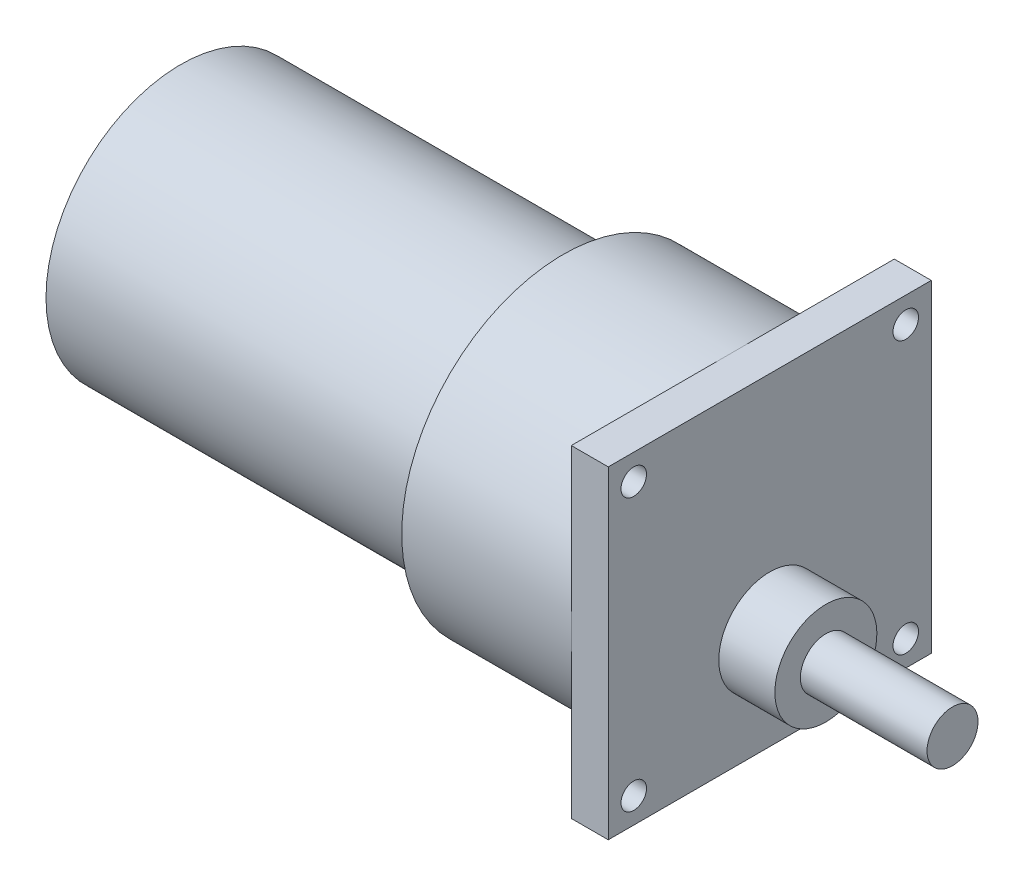
ISO-10303-21;
HEADER;
FILE_DESCRIPTION(('STEP AP214'),'2;1');
FILE_NAME('part.step','',(''),(''),'','','');
FILE_SCHEMA(('AUTOMOTIVE_DESIGN { 1 0 10303 214 1 1 1 1 }'));
ENDSEC;
DATA;
#1=APPLICATION_CONTEXT('core data for automotive mechanical design processes');
#2=APPLICATION_PROTOCOL_DEFINITION('international standard','automotive_design',2000,#1);
#3=PRODUCT_CONTEXT('',#1,'mechanical');
#4=PRODUCT('Part','Part','',(#3));
#5=PRODUCT_RELATED_PRODUCT_CATEGORY('part','',(#4));
#6=PRODUCT_DEFINITION_FORMATION('','',#4);
#7=PRODUCT_DEFINITION_CONTEXT('part definition',#1,'design');
#8=PRODUCT_DEFINITION('design','',#6,#7);
#9=PRODUCT_DEFINITION_SHAPE('','',#8);
#10=(LENGTH_UNIT() NAMED_UNIT(*) SI_UNIT(.MILLI.,.METRE.));
#11=(NAMED_UNIT(*) PLANE_ANGLE_UNIT() SI_UNIT($,.RADIAN.));
#12=(NAMED_UNIT(*) SI_UNIT($,.STERADIAN.) SOLID_ANGLE_UNIT());
#13=UNCERTAINTY_MEASURE_WITH_UNIT(LENGTH_MEASURE(1.E-05),#10,'distance_accuracy_value','');
#14=(GEOMETRIC_REPRESENTATION_CONTEXT(3) GLOBAL_UNCERTAINTY_ASSIGNED_CONTEXT((#13)) GLOBAL_UNIT_ASSIGNED_CONTEXT((#10,
#11,#12)) REPRESENTATION_CONTEXT('',''));
#15=CARTESIAN_POINT('',(0.,0.,0.));
#16=DIRECTION('',(0.,0.,1.));
#17=DIRECTION('',(1.,0.,0.));
#18=AXIS2_PLACEMENT_3D('',#15,#16,#17);
#19=CARTESIAN_POINT('',(0.,0.,0.));
#20=DIRECTION('',(1.,0.,0.));
#21=DIRECTION('',(0.,0.,-1.));
#22=AXIS2_PLACEMENT_3D('',#19,#20,#21);
#23=PLANE('',#22);
#24=CARTESIAN_POINT('',(0.,-16.0000000000001,16.));
#25=DIRECTION('',(1.,0.,0.));
#26=DIRECTION('',(0.,0.,-1.));
#27=AXIS2_PLACEMENT_3D('',#24,#25,#26);
#28=CIRCLE('',#27,1.5);
#29=CARTESIAN_POINT('',(0.,-16.0000000000001,14.5));
#30=VERTEX_POINT('',#29);
#31=EDGE_CURVE('E212',#30,#30,#28,.F.);
#32=ORIENTED_EDGE('',*,*,#31,.T.);
#33=EDGE_LOOP('',(#32));
#34=FACE_BOUND('',#33,.T.);
#35=CARTESIAN_POINT('',(0.,-16.0000000000001,-16.));
#36=DIRECTION('',(1.,0.,0.));
#37=DIRECTION('',(0.,0.,-1.));
#38=AXIS2_PLACEMENT_3D('',#35,#36,#37);
#39=CIRCLE('',#38,1.5);
#40=CARTESIAN_POINT('',(0.,-16.0000000000001,-17.5));
#41=VERTEX_POINT('',#40);
#42=EDGE_CURVE('E216',#41,#41,#39,.T.);
#43=ORIENTED_EDGE('',*,*,#42,.F.);
#44=EDGE_LOOP('',(#43));
#45=FACE_BOUND('',#44,.T.);
#46=CARTESIAN_POINT('',(0.,16.0000000000001,16.));
#47=DIRECTION('',(1.,0.,0.));
#48=DIRECTION('',(0.,0.,-1.));
#49=AXIS2_PLACEMENT_3D('',#46,#47,#48);
#50=CIRCLE('',#49,1.5);
#51=CARTESIAN_POINT('',(0.,16.0000000000001,14.5));
#52=VERTEX_POINT('',#51);
#53=EDGE_CURVE('E220',#52,#52,#50,.T.);
#54=ORIENTED_EDGE('',*,*,#53,.F.);
#55=EDGE_LOOP('',(#54));
#56=FACE_BOUND('',#55,.T.);
#57=CARTESIAN_POINT('',(0.,-7.2,0.));
#58=DIRECTION('',(-1.,0.,0.));
#59=DIRECTION('',(0.,-1.,0.));
#60=AXIS2_PLACEMENT_3D('',#57,#58,#59);
#61=CIRCLE('',#60,6.);
#62=CARTESIAN_POINT('',(0.,-13.2,0.));
#63=VERTEX_POINT('',#62);
#64=EDGE_CURVE('E152',#63,#63,#61,.T.);
#65=ORIENTED_EDGE('',*,*,#64,.T.);
#66=EDGE_LOOP('',(#65));
#67=FACE_BOUND('',#66,.T.);
#68=DIRECTION('',(0.,-1.,0.));
#69=VECTOR('',#68,1.);
#70=CARTESIAN_POINT('',(0.,0.,19.));
#71=LINE('',#70,#69);
#72=CARTESIAN_POINT('',(0.,19.,19.));
#73=VERTEX_POINT('',#72);
#74=CARTESIAN_POINT('',(0.,-19.,19.));
#75=VERTEX_POINT('',#74);
#76=EDGE_CURVE('E179',#73,#75,#71,.T.);
#77=ORIENTED_EDGE('',*,*,#76,.T.);
#78=DIRECTION('',(0.,0.,-1.));
#79=VECTOR('',#78,1.);
#80=CARTESIAN_POINT('',(0.,-19.,0.));
#81=LINE('',#80,#79);
#82=CARTESIAN_POINT('',(0.,-19.,-19.));
#83=VERTEX_POINT('',#82);
#84=EDGE_CURVE('E134',#75,#83,#81,.T.);
#85=ORIENTED_EDGE('',*,*,#84,.T.);
#86=DIRECTION('',(0.,-1.,0.));
#87=VECTOR('',#86,1.);
#88=CARTESIAN_POINT('',(0.,0.,-19.));
#89=LINE('',#88,#87);
#90=CARTESIAN_POINT('',(0.,19.,-19.));
#91=VERTEX_POINT('',#90);
#92=EDGE_CURVE('E160',#91,#83,#89,.T.);
#93=ORIENTED_EDGE('',*,*,#92,.F.);
#94=DIRECTION('',(0.,0.,-1.));
#95=VECTOR('',#94,1.);
#96=CARTESIAN_POINT('',(0.,19.,0.));
#97=LINE('',#96,#95);
#98=EDGE_CURVE('E173',#73,#91,#97,.T.);
#99=ORIENTED_EDGE('',*,*,#98,.F.);
#100=EDGE_LOOP('',(#77,#85,#93,#99));
#101=FACE_BOUND('',#100,.T.);
#102=CARTESIAN_POINT('',(0.,16.0000000000001,-16.));
#103=DIRECTION('',(1.,0.,0.));
#104=DIRECTION('',(0.,0.,-1.));
#105=AXIS2_PLACEMENT_3D('',#102,#103,#104);
#106=CIRCLE('',#105,1.5);
#107=CARTESIAN_POINT('',(0.,16.0000000000001,-17.5));
#108=VERTEX_POINT('',#107);
#109=EDGE_CURVE('E227',#108,#108,#106,.F.);
#110=ORIENTED_EDGE('',*,*,#109,.T.);
#111=EDGE_LOOP('',(#110));
#112=FACE_BOUND('',#111,.T.);
#113=ADVANCED_FACE('F71',(#34,#45,#56,#67,#101,#112),#23,.T.);
#114=CARTESIAN_POINT('',(-24.3,0.,0.));
#115=DIRECTION('',(1.,0.,0.));
#116=DIRECTION('',(0.,0.,-1.));
#117=AXIS2_PLACEMENT_3D('',#114,#115,#116);
#118=CYLINDRICAL_SURFACE('',#117,19.);
#119=CARTESIAN_POINT('',(-24.3,0.,0.));
#120=DIRECTION('',(1.,0.,0.));
#121=DIRECTION('',(0.,0.,-1.));
#122=AXIS2_PLACEMENT_3D('',#119,#120,#121);
#123=CIRCLE('',#122,19.);
#124=CARTESIAN_POINT('',(-24.3,0.,-19.));
#125=VERTEX_POINT('',#124);
#126=EDGE_CURVE('E75',#125,#125,#123,.T.);
#127=ORIENTED_EDGE('',*,*,#126,.T.);
#128=EDGE_LOOP('',(#127));
#129=FACE_BOUND('',#128,.T.);
#130=CARTESIAN_POINT('',(-4.35,0.,0.));
#131=DIRECTION('',(1.,0.,0.));
#132=DIRECTION('',(0.,0.,-1.));
#133=AXIS2_PLACEMENT_3D('',#130,#131,#132);
#134=CIRCLE('',#133,19.);
#135=CARTESIAN_POINT('',(-4.35,-19.,0.));
#136=VERTEX_POINT('',#135);
#137=CARTESIAN_POINT('',(-4.35,0.,-19.));
#138=VERTEX_POINT('',#137);
#139=EDGE_CURVE('E87',#136,#138,#134,.T.);
#140=ORIENTED_EDGE('',*,*,#139,.F.);
#141=CARTESIAN_POINT('',(-4.35,0.,0.));
#142=DIRECTION('',(1.,0.,0.));
#143=DIRECTION('',(0.,0.,-1.));
#144=AXIS2_PLACEMENT_3D('',#141,#142,#143);
#145=CIRCLE('',#144,19.);
#146=CARTESIAN_POINT('',(-4.35,0.,19.));
#147=VERTEX_POINT('',#146);
#148=EDGE_CURVE('E137',#147,#136,#145,.T.);
#149=ORIENTED_EDGE('',*,*,#148,.F.);
#150=CARTESIAN_POINT('',(-4.35,0.,0.));
#151=DIRECTION('',(1.,0.,0.));
#152=DIRECTION('',(0.,0.,-1.));
#153=AXIS2_PLACEMENT_3D('',#150,#151,#152);
#154=CIRCLE('',#153,19.);
#155=CARTESIAN_POINT('',(-4.35,19.,0.));
#156=VERTEX_POINT('',#155);
#157=EDGE_CURVE('E175',#156,#147,#154,.T.);
#158=ORIENTED_EDGE('',*,*,#157,.F.);
#159=CARTESIAN_POINT('',(-4.35,0.,0.));
#160=DIRECTION('',(1.,0.,0.));
#161=DIRECTION('',(0.,0.,-1.));
#162=AXIS2_PLACEMENT_3D('',#159,#160,#161);
#163=CIRCLE('',#162,19.);
#164=EDGE_CURVE('E92',#138,#156,#163,.T.);
#165=ORIENTED_EDGE('',*,*,#164,.F.);
#166=EDGE_LOOP('',(#140,#149,#158,#165));
#167=FACE_BOUND('',#166,.T.);
#168=ADVANCED_FACE('F73',(#129,#167),#118,.T.);
#169=CARTESIAN_POINT('',(-24.3,0.,0.));
#170=DIRECTION('',(1.,0.,0.));
#171=DIRECTION('',(0.,0.,-1.));
#172=AXIS2_PLACEMENT_3D('',#169,#170,#171);
#173=PLANE('',#172);
#174=CARTESIAN_POINT('',(-24.3,0.,0.));
#175=DIRECTION('',(-1.,0.,0.));
#176=DIRECTION('',(0.,0.,1.));
#177=AXIS2_PLACEMENT_3D('',#174,#175,#176);
#178=CIRCLE('',#177,15.85);
#179=CARTESIAN_POINT('',(-24.3,0.,15.85));
#180=VERTEX_POINT('',#179);
#181=EDGE_CURVE('E12',#180,#180,#178,.T.);
#182=ORIENTED_EDGE('',*,*,#181,.F.);
#183=EDGE_LOOP('',(#182));
#184=FACE_BOUND('',#183,.T.);
#185=ORIENTED_EDGE('',*,*,#126,.F.);
#186=EDGE_LOOP('',(#185));
#187=FACE_BOUND('',#186,.T.);
#188=ADVANCED_FACE('F191',(#184,#187),#173,.F.);
#189=CARTESIAN_POINT('',(-4.35,0.,19.));
#190=DIRECTION('',(0.,0.,1.));
#191=DIRECTION('',(1.,0.,0.));
#192=AXIS2_PLACEMENT_3D('',#189,#190,#191);
#193=PLANE('',#192);
#194=ORIENTED_EDGE('',*,*,#76,.F.);
#195=DIRECTION('',(1.,0.,0.));
#196=VECTOR('',#195,1.);
#197=CARTESIAN_POINT('',(-4.35,19.,19.));
#198=LINE('',#197,#196);
#199=CARTESIAN_POINT('',(-4.35,19.,19.));
#200=VERTEX_POINT('',#199);
#201=EDGE_CURVE('E182',#200,#73,#198,.T.);
#202=ORIENTED_EDGE('',*,*,#201,.F.);
#203=DIRECTION('',(0.,-1.,0.));
#204=VECTOR('',#203,1.);
#205=CARTESIAN_POINT('',(-4.35,0.,19.));
#206=LINE('',#205,#204);
#207=EDGE_CURVE('E144',#200,#147,#206,.T.);
#208=ORIENTED_EDGE('',*,*,#207,.T.);
#209=DIRECTION('',(0.,-1.,0.));
#210=VECTOR('',#209,1.);
#211=CARTESIAN_POINT('',(-4.35,0.,19.));
#212=LINE('',#211,#210);
#213=CARTESIAN_POINT('',(-4.35,-19.,19.));
#214=VERTEX_POINT('',#213);
#215=EDGE_CURVE('E138',#147,#214,#212,.T.);
#216=ORIENTED_EDGE('',*,*,#215,.T.);
#217=DIRECTION('',(1.,0.,0.));
#218=VECTOR('',#217,1.);
#219=CARTESIAN_POINT('',(-4.35,-19.,19.));
#220=LINE('',#219,#218);
#221=EDGE_CURVE('E126',#214,#75,#220,.T.);
#222=ORIENTED_EDGE('',*,*,#221,.T.);
#223=EDGE_LOOP('',(#194,#202,#208,#216,#222));
#224=FACE_BOUND('',#223,.T.);
#225=ADVANCED_FACE('F142',(#224),#193,.T.);
#226=CARTESIAN_POINT('',(-4.35,19.,0.));
#227=DIRECTION('',(0.,-1.,0.));
#228=DIRECTION('',(0.,0.,-1.));
#229=AXIS2_PLACEMENT_3D('',#226,#227,#228);
#230=PLANE('',#229);
#231=ORIENTED_EDGE('',*,*,#98,.T.);
#232=DIRECTION('',(1.,0.,0.));
#233=VECTOR('',#232,1.);
#234=CARTESIAN_POINT('',(-4.35,19.,-19.));
#235=LINE('',#234,#233);
#236=CARTESIAN_POINT('',(-4.35,19.,-19.));
#237=VERTEX_POINT('',#236);
#238=EDGE_CURVE('E165',#237,#91,#235,.T.);
#239=ORIENTED_EDGE('',*,*,#238,.F.);
#240=DIRECTION('',(0.,0.,-1.));
#241=VECTOR('',#240,1.);
#242=CARTESIAN_POINT('',(-4.35,19.,0.));
#243=LINE('',#242,#241);
#244=EDGE_CURVE('E169',#156,#237,#243,.T.);
#245=ORIENTED_EDGE('',*,*,#244,.F.);
#246=DIRECTION('',(0.,0.,-1.));
#247=VECTOR('',#246,1.);
#248=CARTESIAN_POINT('',(-4.35,19.,0.));
#249=LINE('',#248,#247);
#250=EDGE_CURVE('E178',#200,#156,#249,.T.);
#251=ORIENTED_EDGE('',*,*,#250,.F.);
#252=ORIENTED_EDGE('',*,*,#201,.T.);
#253=EDGE_LOOP('',(#231,#239,#245,#251,#252));
#254=FACE_BOUND('',#253,.T.);
#255=ADVANCED_FACE('F199',(#254),#230,.F.);
#256=CARTESIAN_POINT('',(-4.35,0.,0.));
#257=DIRECTION('',(1.,0.,0.));
#258=DIRECTION('',(0.,0.,-1.));
#259=AXIS2_PLACEMENT_3D('',#256,#257,#258);
#260=PLANE('',#259);
#261=CARTESIAN_POINT('',(-4.34999999999999,16.0000000000001,16.));
#262=DIRECTION('',(1.,0.,0.));
#263=DIRECTION('',(0.,0.,-1.));
#264=AXIS2_PLACEMENT_3D('',#261,#262,#263);
#265=CIRCLE('',#264,1.5);
#266=CARTESIAN_POINT('',(-4.34999999999999,16.0000000000001,14.5));
#267=VERTEX_POINT('',#266);
#268=EDGE_CURVE('E231',#267,#267,#265,.F.);
#269=ORIENTED_EDGE('',*,*,#268,.F.);
#270=EDGE_LOOP('',(#269));
#271=FACE_BOUND('',#270,.T.);
#272=ORIENTED_EDGE('',*,*,#157,.T.);
#273=ORIENTED_EDGE('',*,*,#207,.F.);
#274=ORIENTED_EDGE('',*,*,#250,.T.);
#275=EDGE_LOOP('',(#272,#273,#274));
#276=FACE_BOUND('',#275,.T.);
#277=ADVANCED_FACE('F306',(#271,#276),#260,.F.);
#278=CARTESIAN_POINT('',(-4.35,0.,-19.));
#279=DIRECTION('',(0.,0.,1.));
#280=DIRECTION('',(1.,0.,0.));
#281=AXIS2_PLACEMENT_3D('',#278,#279,#280);
#282=PLANE('',#281);
#283=ORIENTED_EDGE('',*,*,#92,.T.);
#284=DIRECTION('',(1.,0.,0.));
#285=VECTOR('',#284,1.);
#286=CARTESIAN_POINT('',(-4.35,-19.,-19.));
#287=LINE('',#286,#285);
#288=CARTESIAN_POINT('',(-4.35,-19.,-19.));
#289=VERTEX_POINT('',#288);
#290=EDGE_CURVE('E156',#289,#83,#287,.T.);
#291=ORIENTED_EDGE('',*,*,#290,.F.);
#292=DIRECTION('',(0.,-1.,0.));
#293=VECTOR('',#292,1.);
#294=CARTESIAN_POINT('',(-4.35,0.,-19.));
#295=LINE('',#294,#293);
#296=EDGE_CURVE('E161',#138,#289,#295,.T.);
#297=ORIENTED_EDGE('',*,*,#296,.F.);
#298=DIRECTION('',(0.,-1.,0.));
#299=VECTOR('',#298,1.);
#300=CARTESIAN_POINT('',(-4.35,0.,-19.));
#301=LINE('',#300,#299);
#302=EDGE_CURVE('E171',#237,#138,#301,.T.);
#303=ORIENTED_EDGE('',*,*,#302,.F.);
#304=ORIENTED_EDGE('',*,*,#238,.T.);
#305=EDGE_LOOP('',(#283,#291,#297,#303,#304));
#306=FACE_BOUND('',#305,.T.);
#307=ADVANCED_FACE('F303',(#306),#282,.F.);
#308=CARTESIAN_POINT('',(-4.35,0.,0.));
#309=DIRECTION('',(1.,0.,0.));
#310=DIRECTION('',(0.,0.,-1.));
#311=AXIS2_PLACEMENT_3D('',#308,#309,#310);
#312=PLANE('',#311);
#313=CARTESIAN_POINT('',(-4.34999999999999,16.0000000000001,-16.));
#314=DIRECTION('',(1.,0.,0.));
#315=DIRECTION('',(0.,0.,-1.));
#316=AXIS2_PLACEMENT_3D('',#313,#314,#315);
#317=CIRCLE('',#316,1.5);
#318=CARTESIAN_POINT('',(-4.34999999999999,16.0000000000001,-17.5));
#319=VERTEX_POINT('',#318);
#320=EDGE_CURVE('E229',#319,#319,#317,.T.);
#321=ORIENTED_EDGE('',*,*,#320,.T.);
#322=EDGE_LOOP('',(#321));
#323=FACE_BOUND('',#322,.T.);
#324=ORIENTED_EDGE('',*,*,#164,.T.);
#325=ORIENTED_EDGE('',*,*,#244,.T.);
#326=ORIENTED_EDGE('',*,*,#302,.T.);
#327=EDGE_LOOP('',(#324,#325,#326));
#328=FACE_BOUND('',#327,.T.);
#329=ADVANCED_FACE('F299',(#323,#328),#312,.F.);
#330=CARTESIAN_POINT('',(-4.35,-19.,0.));
#331=DIRECTION('',(0.,-1.,0.));
#332=DIRECTION('',(0.,0.,-1.));
#333=AXIS2_PLACEMENT_3D('',#330,#331,#332);
#334=PLANE('',#333);
#335=ORIENTED_EDGE('',*,*,#84,.F.);
#336=ORIENTED_EDGE('',*,*,#221,.F.);
#337=DIRECTION('',(0.,0.,-1.));
#338=VECTOR('',#337,1.);
#339=CARTESIAN_POINT('',(-4.35,-19.,0.));
#340=LINE('',#339,#338);
#341=EDGE_CURVE('E131',#214,#136,#340,.T.);
#342=ORIENTED_EDGE('',*,*,#341,.T.);
#343=DIRECTION('',(0.,0.,-1.));
#344=VECTOR('',#343,1.);
#345=CARTESIAN_POINT('',(-4.35,-19.,0.));
#346=LINE('',#345,#344);
#347=EDGE_CURVE('E158',#136,#289,#346,.T.);
#348=ORIENTED_EDGE('',*,*,#347,.T.);
#349=ORIENTED_EDGE('',*,*,#290,.T.);
#350=EDGE_LOOP('',(#335,#336,#342,#348,#349));
#351=FACE_BOUND('',#350,.T.);
#352=ADVANCED_FACE('F128',(#351),#334,.T.);
#353=CARTESIAN_POINT('',(-4.35,0.,0.));
#354=DIRECTION('',(1.,0.,0.));
#355=DIRECTION('',(0.,0.,-1.));
#356=AXIS2_PLACEMENT_3D('',#353,#354,#355);
#357=PLANE('',#356);
#358=CARTESIAN_POINT('',(-4.34999999999999,-16.0000000000001,-16.));
#359=DIRECTION('',(1.,0.,0.));
#360=DIRECTION('',(0.,0.,-1.));
#361=AXIS2_PLACEMENT_3D('',#358,#359,#360);
#362=CIRCLE('',#361,1.5);
#363=CARTESIAN_POINT('',(-4.34999999999999,-16.0000000000001,-17.5));
#364=VERTEX_POINT('',#363);
#365=EDGE_CURVE('E236',#364,#364,#362,.F.);
#366=ORIENTED_EDGE('',*,*,#365,.F.);
#367=EDGE_LOOP('',(#366));
#368=FACE_BOUND('',#367,.T.);
#369=ORIENTED_EDGE('',*,*,#139,.T.);
#370=ORIENTED_EDGE('',*,*,#296,.T.);
#371=ORIENTED_EDGE('',*,*,#347,.F.);
#372=EDGE_LOOP('',(#369,#370,#371));
#373=FACE_BOUND('',#372,.T.);
#374=ADVANCED_FACE('F295',(#368,#373),#357,.F.);
#375=CARTESIAN_POINT('',(-4.35,0.,0.));
#376=DIRECTION('',(1.,0.,0.));
#377=DIRECTION('',(0.,0.,-1.));
#378=AXIS2_PLACEMENT_3D('',#375,#376,#377);
#379=PLANE('',#378);
#380=CARTESIAN_POINT('',(-4.34999999999999,-16.0000000000001,16.));
#381=DIRECTION('',(1.,0.,0.));
#382=DIRECTION('',(0.,0.,-1.));
#383=AXIS2_PLACEMENT_3D('',#380,#381,#382);
#384=CIRCLE('',#383,1.5);
#385=CARTESIAN_POINT('',(-4.34999999999999,-16.0000000000001,14.5));
#386=VERTEX_POINT('',#385);
#387=EDGE_CURVE('E240',#386,#386,#384,.T.);
#388=ORIENTED_EDGE('',*,*,#387,.T.);
#389=EDGE_LOOP('',(#388));
#390=FACE_BOUND('',#389,.T.);
#391=ORIENTED_EDGE('',*,*,#148,.T.);
#392=ORIENTED_EDGE('',*,*,#341,.F.);
#393=ORIENTED_EDGE('',*,*,#215,.F.);
#394=EDGE_LOOP('',(#391,#392,#393));
#395=FACE_BOUND('',#394,.T.);
#396=ADVANCED_FACE('F148',(#390,#395),#379,.F.);
#397=CARTESIAN_POINT('',(-69.3,0.,0.));
#398=DIRECTION('',(1.,0.,0.));
#399=DIRECTION('',(0.,0.,-1.));
#400=AXIS2_PLACEMENT_3D('',#397,#398,#399);
#401=CYLINDRICAL_SURFACE('',#400,15.85);
#402=CARTESIAN_POINT('',(-69.3,0.,0.));
#403=DIRECTION('',(-1.,0.,0.));
#404=DIRECTION('',(0.,0.,1.));
#405=AXIS2_PLACEMENT_3D('',#402,#403,#404);
#406=CIRCLE('',#405,15.85);
#407=CARTESIAN_POINT('',(-69.3,0.,15.85));
#408=VERTEX_POINT('',#407);
#409=EDGE_CURVE('E149',#408,#408,#406,.T.);
#410=ORIENTED_EDGE('',*,*,#409,.F.);
#411=EDGE_LOOP('',(#410));
#412=FACE_BOUND('',#411,.T.);
#413=ORIENTED_EDGE('',*,*,#181,.T.);
#414=EDGE_LOOP('',(#413));
#415=FACE_BOUND('',#414,.T.);
#416=ADVANCED_FACE('F288',(#412,#415),#401,.T.);
#417=CARTESIAN_POINT('',(-69.3,0.,0.));
#418=DIRECTION('',(-1.,0.,0.));
#419=DIRECTION('',(0.,0.,1.));
#420=AXIS2_PLACEMENT_3D('',#417,#418,#419);
#421=PLANE('',#420);
#422=ORIENTED_EDGE('',*,*,#409,.T.);
#423=EDGE_LOOP('',(#422));
#424=FACE_BOUND('',#423,.T.);
#425=ADVANCED_FACE('F284',(#424),#421,.T.);
#426=CARTESIAN_POINT('',(0.,-7.2,0.));
#427=DIRECTION('',(-1.,0.,0.));
#428=DIRECTION('',(0.,-1.,0.));
#429=AXIS2_PLACEMENT_3D('',#426,#427,#428);
#430=CYLINDRICAL_SURFACE('',#429,6.);
#431=ORIENTED_EDGE('',*,*,#64,.F.);
#432=EDGE_LOOP('',(#431));
#433=FACE_BOUND('',#432,.T.);
#434=CARTESIAN_POINT('',(6.6,-7.20000000000001,0.));
#435=DIRECTION('',(-1.,0.,0.));
#436=DIRECTION('',(0.,-1.,0.));
#437=AXIS2_PLACEMENT_3D('',#434,#435,#436);
#438=CIRCLE('',#437,6.);
#439=CARTESIAN_POINT('',(6.6,-13.2,0.));
#440=VERTEX_POINT('',#439);
#441=EDGE_CURVE('E251',#440,#440,#438,.T.);
#442=ORIENTED_EDGE('',*,*,#441,.T.);
#443=EDGE_LOOP('',(#442));
#444=FACE_BOUND('',#443,.T.);
#445=ADVANCED_FACE('F256',(#433,#444),#430,.T.);
#446=CARTESIAN_POINT('',(6.6,-1.20000000000001,0.));
#447=DIRECTION('',(-1.,0.,0.));
#448=DIRECTION('',(0.,-1.,0.));
#449=AXIS2_PLACEMENT_3D('',#446,#447,#448);
#450=PLANE('',#449);
#451=ORIENTED_EDGE('',*,*,#441,.F.);
#452=EDGE_LOOP('',(#451));
#453=FACE_BOUND('',#452,.T.);
#454=CARTESIAN_POINT('',(6.6,-7.20000000000001,0.));
#455=DIRECTION('',(-1.,0.,0.));
#456=DIRECTION('',(0.,-1.,0.));
#457=AXIS2_PLACEMENT_3D('',#454,#455,#456);
#458=CIRCLE('',#457,3.);
#459=CARTESIAN_POINT('',(6.6,-10.2,0.));
#460=VERTEX_POINT('',#459);
#461=EDGE_CURVE('E248',#460,#460,#458,.T.);
#462=ORIENTED_EDGE('',*,*,#461,.T.);
#463=EDGE_LOOP('',(#462));
#464=FACE_BOUND('',#463,.T.);
#465=ADVANCED_FACE('F258',(#453,#464),#450,.F.);
#466=CARTESIAN_POINT('',(0.,-7.2,0.));
#467=DIRECTION('',(-1.,0.,0.));
#468=DIRECTION('',(0.,-1.,0.));
#469=AXIS2_PLACEMENT_3D('',#466,#467,#468);
#470=CYLINDRICAL_SURFACE('',#469,3.);
#471=ORIENTED_EDGE('',*,*,#461,.F.);
#472=EDGE_LOOP('',(#471));
#473=FACE_BOUND('',#472,.T.);
#474=CARTESIAN_POINT('',(21.5,-7.20000000000001,0.));
#475=DIRECTION('',(-1.,0.,0.));
#476=DIRECTION('',(0.,-1.,0.));
#477=AXIS2_PLACEMENT_3D('',#474,#475,#476);
#478=CIRCLE('',#477,3.);
#479=CARTESIAN_POINT('',(21.5,-10.2,0.));
#480=VERTEX_POINT('',#479);
#481=EDGE_CURVE('E245',#480,#480,#478,.T.);
#482=ORIENTED_EDGE('',*,*,#481,.T.);
#483=EDGE_LOOP('',(#482));
#484=FACE_BOUND('',#483,.T.);
#485=ADVANCED_FACE('F261',(#473,#484),#470,.T.);
#486=CARTESIAN_POINT('',(21.5,-4.20000000000001,0.));
#487=DIRECTION('',(-1.,0.,0.));
#488=DIRECTION('',(0.,-1.,0.));
#489=AXIS2_PLACEMENT_3D('',#486,#487,#488);
#490=PLANE('',#489);
#491=ORIENTED_EDGE('',*,*,#481,.F.);
#492=EDGE_LOOP('',(#491));
#493=FACE_BOUND('',#492,.T.);
#494=ADVANCED_FACE('F267',(#493),#490,.F.);
#495=CARTESIAN_POINT('',(-69.301,-16.0000000000001,16.));
#496=DIRECTION('',(1.,0.,0.));
#497=DIRECTION('',(0.,0.,-1.));
#498=AXIS2_PLACEMENT_3D('',#495,#496,#497);
#499=CYLINDRICAL_SURFACE('',#498,1.5);
#500=ORIENTED_EDGE('',*,*,#31,.F.);
#501=EDGE_LOOP('',(#500));
#502=FACE_BOUND('',#501,.T.);
#503=ORIENTED_EDGE('',*,*,#387,.F.);
#504=EDGE_LOOP('',(#503));
#505=FACE_BOUND('',#504,.T.);
#506=ADVANCED_FACE('F272',(#502,#505),#499,.F.);
#507=CARTESIAN_POINT('',(-69.301,-16.0000000000001,-16.));
#508=DIRECTION('',(1.,0.,0.));
#509=DIRECTION('',(0.,0.,-1.));
#510=AXIS2_PLACEMENT_3D('',#507,#508,#509);
#511=CYLINDRICAL_SURFACE('',#510,1.5);
#512=ORIENTED_EDGE('',*,*,#42,.T.);
#513=EDGE_LOOP('',(#512));
#514=FACE_BOUND('',#513,.T.);
#515=ORIENTED_EDGE('',*,*,#365,.T.);
#516=EDGE_LOOP('',(#515));
#517=FACE_BOUND('',#516,.T.);
#518=ADVANCED_FACE('F276',(#514,#517),#511,.F.);
#519=CARTESIAN_POINT('',(-69.301,16.0000000000001,-16.));
#520=DIRECTION('',(1.,0.,0.));
#521=DIRECTION('',(0.,0.,-1.));
#522=AXIS2_PLACEMENT_3D('',#519,#520,#521);
#523=CYLINDRICAL_SURFACE('',#522,1.5);
#524=ORIENTED_EDGE('',*,*,#109,.F.);
#525=EDGE_LOOP('',(#524));
#526=FACE_BOUND('',#525,.T.);
#527=ORIENTED_EDGE('',*,*,#320,.F.);
#528=EDGE_LOOP('',(#527));
#529=FACE_BOUND('',#528,.T.);
#530=ADVANCED_FACE('F423',(#526,#529),#523,.F.);
#531=CARTESIAN_POINT('',(-69.301,16.0000000000001,16.));
#532=DIRECTION('',(1.,0.,0.));
#533=DIRECTION('',(0.,0.,-1.));
#534=AXIS2_PLACEMENT_3D('',#531,#532,#533);
#535=CYLINDRICAL_SURFACE('',#534,1.5);
#536=ORIENTED_EDGE('',*,*,#53,.T.);
#537=EDGE_LOOP('',(#536));
#538=FACE_BOUND('',#537,.T.);
#539=ORIENTED_EDGE('',*,*,#268,.T.);
#540=EDGE_LOOP('',(#539));
#541=FACE_BOUND('',#540,.T.);
#542=ADVANCED_FACE('F280',(#538,#541),#535,.F.);
#543=CLOSED_SHELL('',(#113,#168,#188,#225,#255,#277,#307,#329,#352,#374,#396,#416,#425,#445,
#465,#485,#494,#506,#518,#530,#542));
#544=MANIFOLD_SOLID_BREP('B2',#543);
#545=ADVANCED_BREP_SHAPE_REPRESENTATION('',(#18,#544),#14);
#546=SHAPE_DEFINITION_REPRESENTATION(#9,#545);
ENDSEC;
END-ISO-10303-21;
